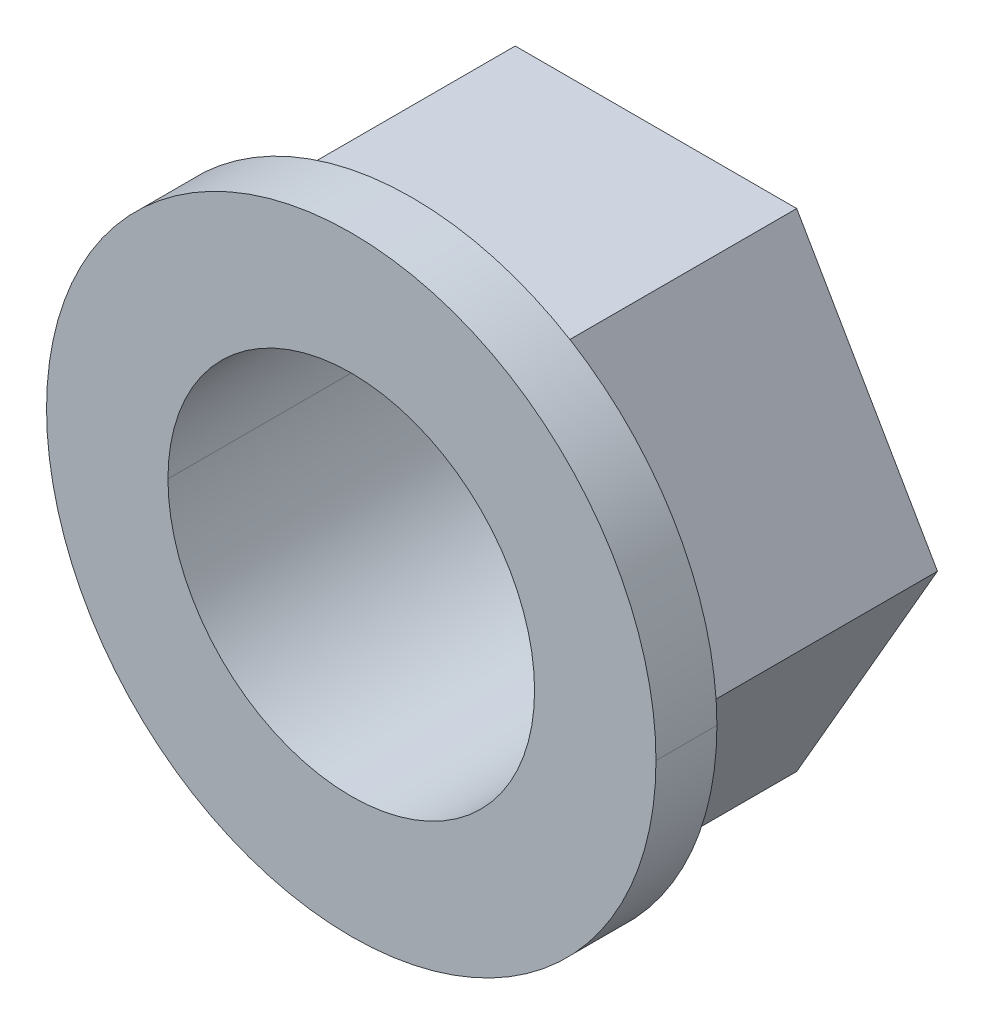
ISO-10303-21;
HEADER;
FILE_DESCRIPTION(('STEP AP214'),'2;1');
FILE_NAME('part.step','',(''),(''),'','','');
FILE_SCHEMA(('AUTOMOTIVE_DESIGN { 1 0 10303 214 1 1 1 1 }'));
ENDSEC;
DATA;
#1=APPLICATION_CONTEXT('core data for automotive mechanical design processes');
#2=APPLICATION_PROTOCOL_DEFINITION('international standard','automotive_design',2000,#1);
#3=PRODUCT_CONTEXT('',#1,'mechanical');
#4=PRODUCT('Part','Part','',(#3));
#5=PRODUCT_RELATED_PRODUCT_CATEGORY('part','',(#4));
#6=PRODUCT_DEFINITION_FORMATION('','',#4);
#7=PRODUCT_DEFINITION_CONTEXT('part definition',#1,'design');
#8=PRODUCT_DEFINITION('design','',#6,#7);
#9=PRODUCT_DEFINITION_SHAPE('','',#8);
#10=(LENGTH_UNIT() NAMED_UNIT(*) SI_UNIT(.MILLI.,.METRE.));
#11=(NAMED_UNIT(*) PLANE_ANGLE_UNIT() SI_UNIT($,.RADIAN.));
#12=(NAMED_UNIT(*) SI_UNIT($,.STERADIAN.) SOLID_ANGLE_UNIT());
#13=UNCERTAINTY_MEASURE_WITH_UNIT(LENGTH_MEASURE(1.E-05),#10,'distance_accuracy_value','');
#14=(GEOMETRIC_REPRESENTATION_CONTEXT(3) GLOBAL_UNCERTAINTY_ASSIGNED_CONTEXT((#13)) GLOBAL_UNIT_ASSIGNED_CONTEXT((#10,
#11,#12)) REPRESENTATION_CONTEXT('',''));
#15=CARTESIAN_POINT('',(0.,0.,0.));
#16=DIRECTION('',(0.,0.,1.));
#17=DIRECTION('',(1.,0.,0.));
#18=AXIS2_PLACEMENT_3D('',#15,#16,#17);
#19=CARTESIAN_POINT('',(0.,0.,1.5875));
#20=DIRECTION('',(0.,0.,-1.));
#21=DIRECTION('',(-1.,0.,0.));
#22=AXIS2_PLACEMENT_3D('',#19,#20,#21);
#23=CYLINDRICAL_SURFACE('',#22,7.9375);
#24=DIRECTION('',(0.,0.,-1.));
#25=VECTOR('',#24,1.);
#26=CARTESIAN_POINT('',(7.9375,0.,1.5875));
#27=LINE('',#26,#25);
#28=CARTESIAN_POINT('',(7.9375,0.,1.5875));
#29=VERTEX_POINT('',#28);
#30=CARTESIAN_POINT('',(7.9375,0.,0.));
#31=VERTEX_POINT('',#30);
#32=EDGE_CURVE('E196',#29,#31,#27,.T.);
#33=ORIENTED_EDGE('',*,*,#32,.F.);
#34=CARTESIAN_POINT('',(0.,0.,1.5875));
#35=DIRECTION('',(0.,0.,1.));
#36=DIRECTION('',(1.,0.,0.));
#37=AXIS2_PLACEMENT_3D('',#34,#35,#36);
#38=CIRCLE('',#37,7.9375);
#39=CARTESIAN_POINT('',(-7.9375,0.,1.5875));
#40=VERTEX_POINT('',#39);
#41=EDGE_CURVE('E11',#40,#29,#38,.T.);
#42=ORIENTED_EDGE('',*,*,#41,.F.);
#43=DIRECTION('',(0.,0.,-1.));
#44=VECTOR('',#43,1.);
#45=CARTESIAN_POINT('',(-7.9375,0.,1.5875));
#46=LINE('',#45,#44);
#47=CARTESIAN_POINT('',(-7.9375,0.,0.));
#48=VERTEX_POINT('',#47);
#49=EDGE_CURVE('E166',#40,#48,#46,.T.);
#50=ORIENTED_EDGE('',*,*,#49,.T.);
#51=CARTESIAN_POINT('',(0.,0.,0.));
#52=DIRECTION('',(0.,0.,1.));
#53=DIRECTION('',(1.,0.,0.));
#54=AXIS2_PLACEMENT_3D('',#51,#52,#53);
#55=CIRCLE('',#54,7.9375);
#56=EDGE_CURVE('E27',#48,#31,#55,.T.);
#57=ORIENTED_EDGE('',*,*,#56,.T.);
#58=EDGE_LOOP('',(#33,#42,#50,#57));
#59=FACE_BOUND('',#58,.T.);
#60=ADVANCED_FACE('F16',(#59),#23,.T.);
#61=CARTESIAN_POINT('',(0.,0.,1.5875));
#62=DIRECTION('',(0.,0.,1.));
#63=DIRECTION('',(1.,0.,0.));
#64=AXIS2_PLACEMENT_3D('',#61,#62,#63);
#65=PLANE('',#64);
#66=CARTESIAN_POINT('',(0.,0.,1.5875));
#67=DIRECTION('',(0.,0.,1.));
#68=DIRECTION('',(1.,0.,0.));
#69=AXIS2_PLACEMENT_3D('',#66,#67,#68);
#70=CIRCLE('',#69,4.7752);
#71=CARTESIAN_POINT('',(4.7752,0.,1.5875));
#72=VERTEX_POINT('',#71);
#73=CARTESIAN_POINT('',(-4.7752,0.,1.5875));
#74=VERTEX_POINT('',#73);
#75=EDGE_CURVE('E128',#72,#74,#70,.T.);
#76=ORIENTED_EDGE('',*,*,#75,.F.);
#77=CARTESIAN_POINT('',(0.,0.,1.5875));
#78=DIRECTION('',(0.,0.,1.));
#79=DIRECTION('',(1.,0.,0.));
#80=AXIS2_PLACEMENT_3D('',#77,#78,#79);
#81=CIRCLE('',#80,4.7752);
#82=EDGE_CURVE('E132',#74,#72,#81,.T.);
#83=ORIENTED_EDGE('',*,*,#82,.F.);
#84=EDGE_LOOP('',(#76,#83));
#85=FACE_BOUND('',#84,.T.);
#86=ORIENTED_EDGE('',*,*,#41,.T.);
#87=CARTESIAN_POINT('',(0.,0.,1.5875));
#88=DIRECTION('',(0.,0.,1.));
#89=DIRECTION('',(1.,0.,0.));
#90=AXIS2_PLACEMENT_3D('',#87,#88,#89);
#91=CIRCLE('',#90,7.9375);
#92=EDGE_CURVE('E203',#29,#40,#91,.T.);
#93=ORIENTED_EDGE('',*,*,#92,.T.);
#94=EDGE_LOOP('',(#86,#93));
#95=FACE_BOUND('',#94,.T.);
#96=ADVANCED_FACE('F18',(#85,#95),#65,.T.);
#97=CARTESIAN_POINT('',(0.,0.,0.));
#98=DIRECTION('',(0.,0.,1.));
#99=DIRECTION('',(1.,0.,0.));
#100=AXIS2_PLACEMENT_3D('',#97,#98,#99);
#101=PLANE('',#100);
#102=DIRECTION('',(1.,0.,0.));
#103=VECTOR('',#102,1.);
#104=CARTESIAN_POINT('',(-3.66617420935412,-6.35,0.));
#105=LINE('',#104,#103);
#106=CARTESIAN_POINT('',(-3.66617420935412,-6.35,0.));
#107=VERTEX_POINT('',#106);
#108=CARTESIAN_POINT('',(3.66617420935412,-6.35,0.));
#109=VERTEX_POINT('',#108);
#110=EDGE_CURVE('E177',#107,#109,#105,.T.);
#111=ORIENTED_EDGE('',*,*,#110,.T.);
#112=DIRECTION('',(0.5,0.866025403784439,0.));
#113=VECTOR('',#112,1.);
#114=CARTESIAN_POINT('',(3.66617420935412,-6.35,0.));
#115=LINE('',#114,#113);
#116=CARTESIAN_POINT('',(7.33234841870825,0.,0.));
#117=VERTEX_POINT('',#116);
#118=EDGE_CURVE('E146',#109,#117,#115,.T.);
#119=ORIENTED_EDGE('',*,*,#118,.T.);
#120=DIRECTION('',(-0.5,0.866025403784439,0.));
#121=VECTOR('',#120,1.);
#122=CARTESIAN_POINT('',(7.33234841870825,0.,0.));
#123=LINE('',#122,#121);
#124=CARTESIAN_POINT('',(3.66617420935412,6.35,0.));
#125=VERTEX_POINT('',#124);
#126=EDGE_CURVE('E181',#117,#125,#123,.T.);
#127=ORIENTED_EDGE('',*,*,#126,.T.);
#128=DIRECTION('',(-1.,0.,0.));
#129=VECTOR('',#128,1.);
#130=CARTESIAN_POINT('',(3.66617420935412,6.35,0.));
#131=LINE('',#130,#129);
#132=CARTESIAN_POINT('',(-3.66617420935412,6.35,0.));
#133=VERTEX_POINT('',#132);
#134=EDGE_CURVE('E102',#125,#133,#131,.T.);
#135=ORIENTED_EDGE('',*,*,#134,.T.);
#136=DIRECTION('',(-0.5,-0.866025403784439,0.));
#137=VECTOR('',#136,1.);
#138=CARTESIAN_POINT('',(-3.66617420935412,6.35,0.));
#139=LINE('',#138,#137);
#140=CARTESIAN_POINT('',(-7.33234841870825,0.,0.));
#141=VERTEX_POINT('',#140);
#142=EDGE_CURVE('E165',#133,#141,#139,.T.);
#143=ORIENTED_EDGE('',*,*,#142,.T.);
#144=DIRECTION('',(0.5,-0.866025403784439,0.));
#145=VECTOR('',#144,1.);
#146=CARTESIAN_POINT('',(-7.33234841870825,0.,0.));
#147=LINE('',#146,#145);
#148=EDGE_CURVE('E200',#141,#107,#147,.T.);
#149=ORIENTED_EDGE('',*,*,#148,.T.);
#150=EDGE_LOOP('',(#111,#119,#127,#135,#143,#149));
#151=FACE_BOUND('',#150,.T.);
#152=ORIENTED_EDGE('',*,*,#56,.F.);
#153=CARTESIAN_POINT('',(0.,0.,0.));
#154=DIRECTION('',(0.,0.,1.));
#155=DIRECTION('',(1.,0.,0.));
#156=AXIS2_PLACEMENT_3D('',#153,#154,#155);
#157=CIRCLE('',#156,7.9375);
#158=EDGE_CURVE('E170',#31,#48,#157,.T.);
#159=ORIENTED_EDGE('',*,*,#158,.F.);
#160=EDGE_LOOP('',(#152,#159));
#161=FACE_BOUND('',#160,.T.);
#162=ADVANCED_FACE('F402',(#151,#161),#101,.F.);
#163=CARTESIAN_POINT('',(0.,0.,-6.35));
#164=DIRECTION('',(0.,0.,1.));
#165=DIRECTION('',(1.,0.,0.));
#166=AXIS2_PLACEMENT_3D('',#163,#164,#165);
#167=CYLINDRICAL_SURFACE('',#166,4.7752);
#168=DIRECTION('',(0.,0.,1.));
#169=VECTOR('',#168,1.);
#170=CARTESIAN_POINT('',(-4.7752,0.,-6.35));
#171=LINE('',#170,#169);
#172=CARTESIAN_POINT('',(-4.7752,0.,-6.35));
#173=VERTEX_POINT('',#172);
#174=EDGE_CURVE('E149',#173,#74,#171,.T.);
#175=ORIENTED_EDGE('',*,*,#174,.F.);
#176=CARTESIAN_POINT('',(0.,0.,-6.35));
#177=DIRECTION('',(0.,0.,1.));
#178=DIRECTION('',(1.,0.,0.));
#179=AXIS2_PLACEMENT_3D('',#176,#177,#178);
#180=CIRCLE('',#179,4.7752);
#181=CARTESIAN_POINT('',(4.7752,0.,-6.35));
#182=VERTEX_POINT('',#181);
#183=EDGE_CURVE('E137',#182,#173,#180,.T.);
#184=ORIENTED_EDGE('',*,*,#183,.F.);
#185=DIRECTION('',(0.,0.,1.));
#186=VECTOR('',#185,1.);
#187=CARTESIAN_POINT('',(4.7752,0.,-6.35));
#188=LINE('',#187,#186);
#189=EDGE_CURVE('E140',#182,#72,#188,.T.);
#190=ORIENTED_EDGE('',*,*,#189,.T.);
#191=ORIENTED_EDGE('',*,*,#75,.T.);
#192=EDGE_LOOP('',(#175,#184,#190,#191));
#193=FACE_BOUND('',#192,.T.);
#194=ADVANCED_FACE('F141',(#193),#167,.F.);
#195=CARTESIAN_POINT('',(0.,0.,-6.35));
#196=DIRECTION('',(0.,0.,1.));
#197=DIRECTION('',(1.,0.,0.));
#198=AXIS2_PLACEMENT_3D('',#195,#196,#197);
#199=PLANE('',#198);
#200=ORIENTED_EDGE('',*,*,#183,.T.);
#201=CARTESIAN_POINT('',(0.,0.,-6.35));
#202=DIRECTION('',(0.,0.,1.));
#203=DIRECTION('',(1.,0.,0.));
#204=AXIS2_PLACEMENT_3D('',#201,#202,#203);
#205=CIRCLE('',#204,4.7752);
#206=EDGE_CURVE('E155',#173,#182,#205,.T.);
#207=ORIENTED_EDGE('',*,*,#206,.T.);
#208=EDGE_LOOP('',(#200,#207));
#209=FACE_BOUND('',#208,.T.);
#210=DIRECTION('',(0.5,0.866025403784439,0.));
#211=VECTOR('',#210,1.);
#212=CARTESIAN_POINT('',(3.66617420935412,-6.35,-6.35));
#213=LINE('',#212,#211);
#214=CARTESIAN_POINT('',(3.66617420935412,-6.35,-6.35));
#215=VERTEX_POINT('',#214);
#216=CARTESIAN_POINT('',(7.33234841870825,0.,-6.35));
#217=VERTEX_POINT('',#216);
#218=EDGE_CURVE('E184',#215,#217,#213,.T.);
#219=ORIENTED_EDGE('',*,*,#218,.F.);
#220=DIRECTION('',(1.,0.,0.));
#221=VECTOR('',#220,1.);
#222=CARTESIAN_POINT('',(-3.66617420935412,-6.35,-6.35));
#223=LINE('',#222,#221);
#224=CARTESIAN_POINT('',(-3.66617420935412,-6.35,-6.35));
#225=VERTEX_POINT('',#224);
#226=EDGE_CURVE('E197',#225,#215,#223,.T.);
#227=ORIENTED_EDGE('',*,*,#226,.F.);
#228=DIRECTION('',(0.5,-0.866025403784439,0.));
#229=VECTOR('',#228,1.);
#230=CARTESIAN_POINT('',(-7.33234841870825,0.,-6.35));
#231=LINE('',#230,#229);
#232=CARTESIAN_POINT('',(-7.33234841870825,0.,-6.35));
#233=VERTEX_POINT('',#232);
#234=EDGE_CURVE('E211',#233,#225,#231,.T.);
#235=ORIENTED_EDGE('',*,*,#234,.F.);
#236=DIRECTION('',(-0.5,-0.866025403784439,0.));
#237=VECTOR('',#236,1.);
#238=CARTESIAN_POINT('',(-3.66617420935412,6.35,-6.35));
#239=LINE('',#238,#237);
#240=CARTESIAN_POINT('',(-3.66617420935412,6.35,-6.35));
#241=VERTEX_POINT('',#240);
#242=EDGE_CURVE('E164',#241,#233,#239,.T.);
#243=ORIENTED_EDGE('',*,*,#242,.F.);
#244=DIRECTION('',(-1.,0.,0.));
#245=VECTOR('',#244,1.);
#246=CARTESIAN_POINT('',(3.66617420935412,6.35,-6.35));
#247=LINE('',#246,#245);
#248=CARTESIAN_POINT('',(3.66617420935412,6.35,-6.35));
#249=VERTEX_POINT('',#248);
#250=EDGE_CURVE('E113',#249,#241,#247,.T.);
#251=ORIENTED_EDGE('',*,*,#250,.F.);
#252=DIRECTION('',(-0.5,0.866025403784439,0.));
#253=VECTOR('',#252,1.);
#254=CARTESIAN_POINT('',(7.33234841870825,0.,-6.35));
#255=LINE('',#254,#253);
#256=EDGE_CURVE('E41',#217,#249,#255,.T.);
#257=ORIENTED_EDGE('',*,*,#256,.F.);
#258=EDGE_LOOP('',(#219,#227,#235,#243,#251,#257));
#259=FACE_BOUND('',#258,.T.);
#260=ADVANCED_FACE('F235',(#209,#259),#199,.F.);
#261=CARTESIAN_POINT('',(7.33234841870825,0.,-6.35));
#262=DIRECTION('',(0.866025403784439,0.5,0.));
#263=DIRECTION('',(0.,0.,-1.));
#264=AXIS2_PLACEMENT_3D('',#261,#262,#263);
#265=PLANE('',#264);
#266=ORIENTED_EDGE('',*,*,#126,.F.);
#267=DIRECTION('',(0.,0.,1.));
#268=VECTOR('',#267,1.);
#269=CARTESIAN_POINT('',(7.33234841870825,0.,-6.35));
#270=LINE('',#269,#268);
#271=EDGE_CURVE('E179',#217,#117,#270,.T.);
#272=ORIENTED_EDGE('',*,*,#271,.F.);
#273=ORIENTED_EDGE('',*,*,#256,.T.);
#274=DIRECTION('',(0.,0.,1.));
#275=VECTOR('',#274,1.);
#276=CARTESIAN_POINT('',(3.66617420935412,6.35,-6.35));
#277=LINE('',#276,#275);
#278=EDGE_CURVE('E158',#249,#125,#277,.T.);
#279=ORIENTED_EDGE('',*,*,#278,.T.);
#280=EDGE_LOOP('',(#266,#272,#273,#279));
#281=FACE_BOUND('',#280,.T.);
#282=ADVANCED_FACE('F238',(#281),#265,.T.);
#283=CARTESIAN_POINT('',(3.66617420935412,6.35,-6.35));
#284=DIRECTION('',(0.,1.,0.));
#285=DIRECTION('',(1.,0.,0.));
#286=AXIS2_PLACEMENT_3D('',#283,#284,#285);
#287=PLANE('',#286);
#288=ORIENTED_EDGE('',*,*,#134,.F.);
#289=ORIENTED_EDGE('',*,*,#278,.F.);
#290=ORIENTED_EDGE('',*,*,#250,.T.);
#291=DIRECTION('',(0.,0.,1.));
#292=VECTOR('',#291,1.);
#293=CARTESIAN_POINT('',(-3.66617420935412,6.35,-6.35));
#294=LINE('',#293,#292);
#295=EDGE_CURVE('E161',#241,#133,#294,.T.);
#296=ORIENTED_EDGE('',*,*,#295,.T.);
#297=EDGE_LOOP('',(#288,#289,#290,#296));
#298=FACE_BOUND('',#297,.T.);
#299=ADVANCED_FACE('F385',(#298),#287,.T.);
#300=CARTESIAN_POINT('',(-3.66617420935412,6.35,-6.35));
#301=DIRECTION('',(-0.866025403784439,0.5,0.));
#302=DIRECTION('',(0.,0.,1.));
#303=AXIS2_PLACEMENT_3D('',#300,#301,#302);
#304=PLANE('',#303);
#305=ORIENTED_EDGE('',*,*,#142,.F.);
#306=ORIENTED_EDGE('',*,*,#295,.F.);
#307=ORIENTED_EDGE('',*,*,#242,.T.);
#308=DIRECTION('',(0.,0.,1.));
#309=VECTOR('',#308,1.);
#310=CARTESIAN_POINT('',(-7.33234841870825,0.,-6.35));
#311=LINE('',#310,#309);
#312=EDGE_CURVE('E207',#233,#141,#311,.T.);
#313=ORIENTED_EDGE('',*,*,#312,.T.);
#314=EDGE_LOOP('',(#305,#306,#307,#313));
#315=FACE_BOUND('',#314,.T.);
#316=ADVANCED_FACE('F394',(#315),#304,.T.);
#317=CARTESIAN_POINT('',(-7.33234841870825,0.,-6.35));
#318=DIRECTION('',(-0.866025403784438,-0.5,0.));
#319=DIRECTION('',(-0.5,0.866025403784438,0.));
#320=AXIS2_PLACEMENT_3D('',#317,#318,#319);
#321=PLANE('',#320);
#322=ORIENTED_EDGE('',*,*,#148,.F.);
#323=ORIENTED_EDGE('',*,*,#312,.F.);
#324=ORIENTED_EDGE('',*,*,#234,.T.);
#325=DIRECTION('',(0.,0.,1.));
#326=VECTOR('',#325,1.);
#327=CARTESIAN_POINT('',(-3.66617420935412,-6.35,-6.35));
#328=LINE('',#327,#326);
#329=EDGE_CURVE('E20',#225,#107,#328,.T.);
#330=ORIENTED_EDGE('',*,*,#329,.T.);
#331=EDGE_LOOP('',(#322,#323,#324,#330));
#332=FACE_BOUND('',#331,.T.);
#333=ADVANCED_FACE('F390',(#332),#321,.T.);
#334=CARTESIAN_POINT('',(-3.66617420935412,-6.35,-6.35));
#335=DIRECTION('',(0.,-1.,0.));
#336=DIRECTION('',(0.,0.,-1.));
#337=AXIS2_PLACEMENT_3D('',#334,#335,#336);
#338=PLANE('',#337);
#339=ORIENTED_EDGE('',*,*,#110,.F.);
#340=ORIENTED_EDGE('',*,*,#329,.F.);
#341=ORIENTED_EDGE('',*,*,#226,.T.);
#342=DIRECTION('',(0.,0.,1.));
#343=VECTOR('',#342,1.);
#344=CARTESIAN_POINT('',(3.66617420935412,-6.35,-6.35));
#345=LINE('',#344,#343);
#346=EDGE_CURVE('E176',#215,#109,#345,.T.);
#347=ORIENTED_EDGE('',*,*,#346,.T.);
#348=EDGE_LOOP('',(#339,#340,#341,#347));
#349=FACE_BOUND('',#348,.T.);
#350=ADVANCED_FACE('F250',(#349),#338,.T.);
#351=CARTESIAN_POINT('',(3.66617420935412,-6.35,-6.35));
#352=DIRECTION('',(0.866025403784439,-0.5,0.));
#353=DIRECTION('',(0.,0.,-1.));
#354=AXIS2_PLACEMENT_3D('',#351,#352,#353);
#355=PLANE('',#354);
#356=ORIENTED_EDGE('',*,*,#118,.F.);
#357=ORIENTED_EDGE('',*,*,#346,.F.);
#358=ORIENTED_EDGE('',*,*,#218,.T.);
#359=ORIENTED_EDGE('',*,*,#271,.T.);
#360=EDGE_LOOP('',(#356,#357,#358,#359));
#361=FACE_BOUND('',#360,.T.);
#362=ADVANCED_FACE('F247',(#361),#355,.T.);
#363=CARTESIAN_POINT('',(0.,0.,-6.35));
#364=DIRECTION('',(0.,0.,1.));
#365=DIRECTION('',(1.,0.,0.));
#366=AXIS2_PLACEMENT_3D('',#363,#364,#365);
#367=CYLINDRICAL_SURFACE('',#366,4.7752);
#368=ORIENTED_EDGE('',*,*,#206,.F.);
#369=ORIENTED_EDGE('',*,*,#174,.T.);
#370=ORIENTED_EDGE('',*,*,#82,.T.);
#371=ORIENTED_EDGE('',*,*,#189,.F.);
#372=EDGE_LOOP('',(#368,#369,#370,#371));
#373=FACE_BOUND('',#372,.T.);
#374=ADVANCED_FACE('F148',(#373),#367,.F.);
#375=CARTESIAN_POINT('',(0.,0.,1.5875));
#376=DIRECTION('',(0.,0.,-1.));
#377=DIRECTION('',(-1.,0.,0.));
#378=AXIS2_PLACEMENT_3D('',#375,#376,#377);
#379=CYLINDRICAL_SURFACE('',#378,7.9375);
#380=ORIENTED_EDGE('',*,*,#92,.F.);
#381=ORIENTED_EDGE('',*,*,#32,.T.);
#382=ORIENTED_EDGE('',*,*,#158,.T.);
#383=ORIENTED_EDGE('',*,*,#49,.F.);
#384=EDGE_LOOP('',(#380,#381,#382,#383));
#385=FACE_BOUND('',#384,.T.);
#386=ADVANCED_FACE('F407',(#385),#379,.T.);
#387=CLOSED_SHELL('',(#60,#96,#162,#194,#260,#282,#299,#316,#333,#350,#362,#374,#386));
#388=MANIFOLD_SOLID_BREP('B1',#387);
#389=ADVANCED_BREP_SHAPE_REPRESENTATION('',(#18,#388),#14);
#390=SHAPE_DEFINITION_REPRESENTATION(#9,#389);
ENDSEC;
END-ISO-10303-21;
